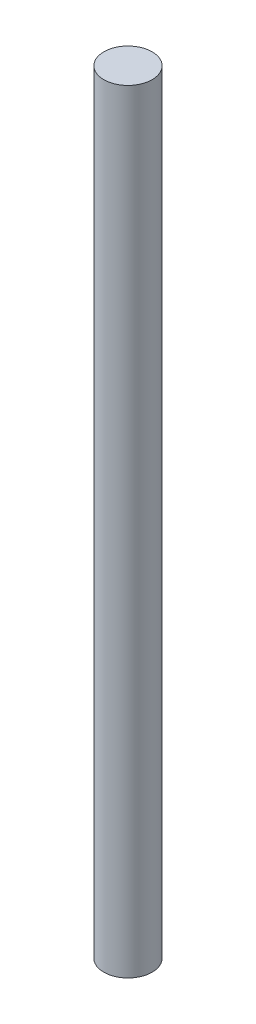
ISO-10303-21;
HEADER;
FILE_DESCRIPTION(('STEP AP214'),'2;1');
FILE_NAME('part.step','',(''),(''),'','','');
FILE_SCHEMA(('AUTOMOTIVE_DESIGN { 1 0 10303 214 1 1 1 1 }'));
ENDSEC;
DATA;
#1=APPLICATION_CONTEXT('core data for automotive mechanical design processes');
#2=APPLICATION_PROTOCOL_DEFINITION('international standard','automotive_design',2000,#1);
#3=PRODUCT_CONTEXT('',#1,'mechanical');
#4=PRODUCT('Part','Part','',(#3));
#5=PRODUCT_RELATED_PRODUCT_CATEGORY('part','',(#4));
#6=PRODUCT_DEFINITION_FORMATION('','',#4);
#7=PRODUCT_DEFINITION_CONTEXT('part definition',#1,'design');
#8=PRODUCT_DEFINITION('design','',#6,#7);
#9=PRODUCT_DEFINITION_SHAPE('','',#8);
#10=(LENGTH_UNIT() NAMED_UNIT(*) SI_UNIT(.MILLI.,.METRE.));
#11=(NAMED_UNIT(*) PLANE_ANGLE_UNIT() SI_UNIT($,.RADIAN.));
#12=(NAMED_UNIT(*) SI_UNIT($,.STERADIAN.) SOLID_ANGLE_UNIT());
#13=UNCERTAINTY_MEASURE_WITH_UNIT(LENGTH_MEASURE(1.E-05),#10,'distance_accuracy_value','');
#14=(GEOMETRIC_REPRESENTATION_CONTEXT(3) GLOBAL_UNCERTAINTY_ASSIGNED_CONTEXT((#13)) GLOBAL_UNIT_ASSIGNED_CONTEXT((#10,
#11,#12)) REPRESENTATION_CONTEXT('',''));
#15=CARTESIAN_POINT('',(0.,0.,0.));
#16=DIRECTION('',(0.,0.,1.));
#17=DIRECTION('',(1.,0.,0.));
#18=AXIS2_PLACEMENT_3D('',#15,#16,#17);
#19=CARTESIAN_POINT('',(0.,101.6,0.));
#20=DIRECTION('',(0.,-1.,0.));
#21=DIRECTION('',(0.,0.,-1.));
#22=AXIS2_PLACEMENT_3D('',#19,#20,#21);
#23=CYLINDRICAL_SURFACE('',#22,3.175);
#24=CARTESIAN_POINT('',(0.,101.6,0.));
#25=DIRECTION('',(0.,1.,0.));
#26=DIRECTION('',(0.,0.,1.));
#27=AXIS2_PLACEMENT_3D('',#24,#25,#26);
#28=CIRCLE('',#27,3.175);
#29=CARTESIAN_POINT('',(0.,101.6,3.175));
#30=VERTEX_POINT('',#29);
#31=EDGE_CURVE('E10',#30,#30,#28,.T.);
#32=ORIENTED_EDGE('',*,*,#31,.F.);
#33=EDGE_LOOP('',(#32));
#34=FACE_BOUND('',#33,.T.);
#35=CARTESIAN_POINT('',(0.,0.,0.));
#36=DIRECTION('',(0.,1.,0.));
#37=DIRECTION('',(0.,0.,1.));
#38=AXIS2_PLACEMENT_3D('',#35,#36,#37);
#39=CIRCLE('',#38,3.175);
#40=CARTESIAN_POINT('',(0.,0.,3.175));
#41=VERTEX_POINT('',#40);
#42=EDGE_CURVE('E34',#41,#41,#39,.T.);
#43=ORIENTED_EDGE('',*,*,#42,.T.);
#44=EDGE_LOOP('',(#43));
#45=FACE_BOUND('',#44,.T.);
#46=ADVANCED_FACE('F31',(#34,#45),#23,.T.);
#47=CARTESIAN_POINT('',(0.,101.6,0.));
#48=DIRECTION('',(0.,1.,0.));
#49=DIRECTION('',(0.,0.,1.));
#50=AXIS2_PLACEMENT_3D('',#47,#48,#49);
#51=PLANE('',#50);
#52=ORIENTED_EDGE('',*,*,#31,.T.);
#53=EDGE_LOOP('',(#52));
#54=FACE_BOUND('',#53,.T.);
#55=ADVANCED_FACE('F46',(#54),#51,.T.);
#56=CARTESIAN_POINT('',(0.,0.,0.));
#57=DIRECTION('',(0.,1.,0.));
#58=DIRECTION('',(0.,0.,1.));
#59=AXIS2_PLACEMENT_3D('',#56,#57,#58);
#60=PLANE('',#59);
#61=ORIENTED_EDGE('',*,*,#42,.F.);
#62=EDGE_LOOP('',(#61));
#63=FACE_BOUND('',#62,.T.);
#64=ADVANCED_FACE('F44',(#63),#60,.F.);
#65=CLOSED_SHELL('',(#46,#55,#64));
#66=MANIFOLD_SOLID_BREP('B2',#65);
#67=ADVANCED_BREP_SHAPE_REPRESENTATION('',(#18,#66),#14);
#68=SHAPE_DEFINITION_REPRESENTATION(#9,#67);
ENDSEC;
END-ISO-10303-21;
